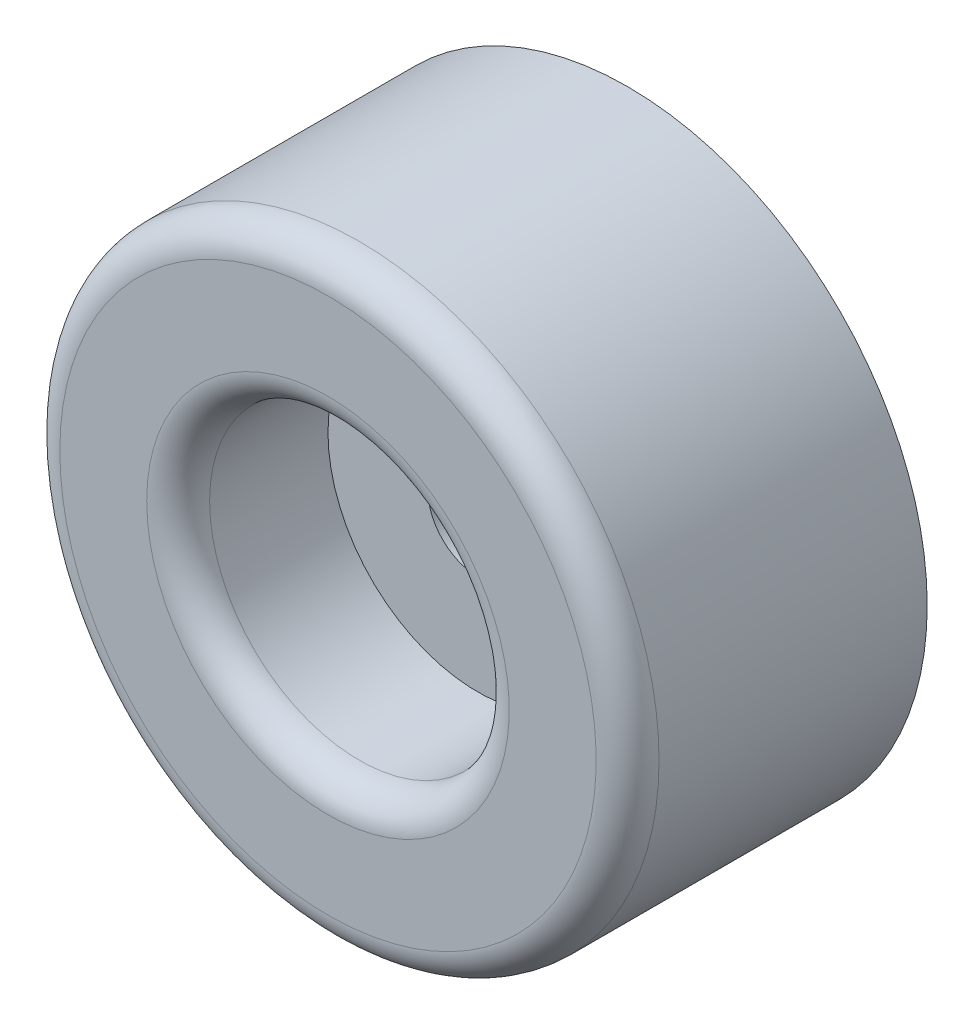
ISO-10303-21;
HEADER;
FILE_DESCRIPTION(('STEP AP214'),'2;1');
FILE_NAME('part.step','',(''),(''),'','','');
FILE_SCHEMA(('AUTOMOTIVE_DESIGN { 1 0 10303 214 1 1 1 1 }'));
ENDSEC;
DATA;
#1=APPLICATION_CONTEXT('core data for automotive mechanical design processes');
#2=APPLICATION_PROTOCOL_DEFINITION('international standard','automotive_design',2000,#1);
#3=PRODUCT_CONTEXT('',#1,'mechanical');
#4=PRODUCT('Part','Part','',(#3));
#5=PRODUCT_RELATED_PRODUCT_CATEGORY('part','',(#4));
#6=PRODUCT_DEFINITION_FORMATION('','',#4);
#7=PRODUCT_DEFINITION_CONTEXT('part definition',#1,'design');
#8=PRODUCT_DEFINITION('design','',#6,#7);
#9=PRODUCT_DEFINITION_SHAPE('','',#8);
#10=(LENGTH_UNIT() NAMED_UNIT(*) SI_UNIT(.MILLI.,.METRE.));
#11=(NAMED_UNIT(*) PLANE_ANGLE_UNIT() SI_UNIT($,.RADIAN.));
#12=(NAMED_UNIT(*) SI_UNIT($,.STERADIAN.) SOLID_ANGLE_UNIT());
#13=UNCERTAINTY_MEASURE_WITH_UNIT(LENGTH_MEASURE(1.E-05),#10,'distance_accuracy_value','');
#14=(GEOMETRIC_REPRESENTATION_CONTEXT(3) GLOBAL_UNCERTAINTY_ASSIGNED_CONTEXT((#13)) GLOBAL_UNIT_ASSIGNED_CONTEXT((#10,
#11,#12)) REPRESENTATION_CONTEXT('',''));
#15=CARTESIAN_POINT('',(0.,0.,0.));
#16=DIRECTION('',(0.,0.,1.));
#17=DIRECTION('',(1.,0.,0.));
#18=AXIS2_PLACEMENT_3D('',#15,#16,#17);
#19=CARTESIAN_POINT('',(0.,0.,13.1472968453587));
#20=DIRECTION('',(0.,0.,1.));
#21=DIRECTION('',(1.,0.,0.));
#22=AXIS2_PLACEMENT_3D('',#19,#20,#21);
#23=CYLINDRICAL_SURFACE('',#22,19.05);
#24=CARTESIAN_POINT('',(0.,0.,17.05));
#25=DIRECTION('',(0.,0.,-1.));
#26=DIRECTION('',(-1.,0.,0.));
#27=AXIS2_PLACEMENT_3D('',#24,#25,#26);
#28=CIRCLE('',#27,19.05);
#29=CARTESIAN_POINT('',(-19.05,0.,17.05));
#30=VERTEX_POINT('',#29);
#31=EDGE_CURVE('E10',#30,#30,#28,.T.);
#32=ORIENTED_EDGE('',*,*,#31,.T.);
#33=EDGE_LOOP('',(#32));
#34=FACE_BOUND('',#33,.T.);
#35=CARTESIAN_POINT('',(0.,0.,0.));
#36=DIRECTION('',(0.,0.,1.));
#37=DIRECTION('',(1.,0.,0.));
#38=AXIS2_PLACEMENT_3D('',#35,#36,#37);
#39=CIRCLE('',#38,19.05);
#40=CARTESIAN_POINT('',(19.05,0.,0.));
#41=VERTEX_POINT('',#40);
#42=EDGE_CURVE('E62',#41,#41,#39,.T.);
#43=ORIENTED_EDGE('',*,*,#42,.T.);
#44=EDGE_LOOP('',(#43));
#45=FACE_BOUND('',#44,.T.);
#46=ADVANCED_FACE('F33',(#34,#45),#23,.T.);
#47=CARTESIAN_POINT('',(0.,19.05,19.05));
#48=DIRECTION('',(0.,0.,-1.));
#49=DIRECTION('',(-1.,0.,0.));
#50=AXIS2_PLACEMENT_3D('',#47,#48,#49);
#51=PLANE('',#50);
#52=CARTESIAN_POINT('',(0.,0.,19.05));
#53=DIRECTION('',(0.,0.,-1.));
#54=DIRECTION('',(-1.,0.,0.));
#55=AXIS2_PLACEMENT_3D('',#52,#53,#54);
#56=CIRCLE('',#55,11.525);
#57=CARTESIAN_POINT('',(-11.525,0.,19.05));
#58=VERTEX_POINT('',#57);
#59=EDGE_CURVE('E40',#58,#58,#56,.T.);
#60=ORIENTED_EDGE('',*,*,#59,.T.);
#61=EDGE_LOOP('',(#60));
#62=FACE_BOUND('',#61,.T.);
#63=CARTESIAN_POINT('',(0.,0.,19.05));
#64=DIRECTION('',(0.,0.,-1.));
#65=DIRECTION('',(-1.,0.,0.));
#66=AXIS2_PLACEMENT_3D('',#63,#64,#65);
#67=CIRCLE('',#66,17.05);
#68=CARTESIAN_POINT('',(-17.05,0.,19.05));
#69=VERTEX_POINT('',#68);
#70=EDGE_CURVE('E44',#69,#69,#67,.F.);
#71=ORIENTED_EDGE('',*,*,#70,.T.);
#72=EDGE_LOOP('',(#71));
#73=FACE_BOUND('',#72,.T.);
#74=ADVANCED_FACE('F88',(#62,#73),#51,.F.);
#75=CARTESIAN_POINT('',(0.,0.,13.1472968453587));
#76=DIRECTION('',(0.,0.,1.));
#77=DIRECTION('',(1.,0.,0.));
#78=AXIS2_PLACEMENT_3D('',#75,#76,#77);
#79=CYLINDRICAL_SURFACE('',#78,9.525);
#80=CARTESIAN_POINT('',(0.,0.,17.05));
#81=DIRECTION('',(0.,0.,-1.));
#82=DIRECTION('',(-1.,0.,0.));
#83=AXIS2_PLACEMENT_3D('',#80,#81,#82);
#84=CIRCLE('',#83,9.525);
#85=CARTESIAN_POINT('',(-9.525,0.,17.05));
#86=VERTEX_POINT('',#85);
#87=EDGE_CURVE('E48',#86,#86,#84,.F.);
#88=ORIENTED_EDGE('',*,*,#87,.T.);
#89=EDGE_LOOP('',(#88));
#90=FACE_BOUND('',#89,.T.);
#91=CARTESIAN_POINT('',(0.,0.,9.525));
#92=DIRECTION('',(0.,0.,1.));
#93=DIRECTION('',(1.,0.,0.));
#94=AXIS2_PLACEMENT_3D('',#91,#92,#93);
#95=CIRCLE('',#94,9.525);
#96=CARTESIAN_POINT('',(9.525,0.,9.525));
#97=VERTEX_POINT('',#96);
#98=EDGE_CURVE('E53',#97,#97,#95,.T.);
#99=ORIENTED_EDGE('',*,*,#98,.F.);
#100=EDGE_LOOP('',(#99));
#101=FACE_BOUND('',#100,.T.);
#102=ADVANCED_FACE('F83',(#90,#101),#79,.F.);
#103=CARTESIAN_POINT('',(0.,9.525,9.525));
#104=DIRECTION('',(0.,0.,-1.));
#105=DIRECTION('',(-1.,0.,0.));
#106=AXIS2_PLACEMENT_3D('',#103,#104,#105);
#107=PLANE('',#106);
#108=CARTESIAN_POINT('',(0.,0.,9.525));
#109=DIRECTION('',(0.,0.,1.));
#110=DIRECTION('',(1.,0.,0.));
#111=AXIS2_PLACEMENT_3D('',#108,#109,#110);
#112=CIRCLE('',#111,3.175);
#113=CARTESIAN_POINT('',(3.175,0.,9.525));
#114=VERTEX_POINT('',#113);
#115=EDGE_CURVE('E56',#114,#114,#112,.T.);
#116=ORIENTED_EDGE('',*,*,#115,.F.);
#117=EDGE_LOOP('',(#116));
#118=FACE_BOUND('',#117,.T.);
#119=ORIENTED_EDGE('',*,*,#98,.T.);
#120=EDGE_LOOP('',(#119));
#121=FACE_BOUND('',#120,.T.);
#122=ADVANCED_FACE('F77',(#118,#121),#107,.F.);
#123=CARTESIAN_POINT('',(0.,0.,13.1472968453587));
#124=DIRECTION('',(0.,0.,1.));
#125=DIRECTION('',(1.,0.,0.));
#126=AXIS2_PLACEMENT_3D('',#123,#124,#125);
#127=CYLINDRICAL_SURFACE('',#126,3.175);
#128=CARTESIAN_POINT('',(0.,0.,0.));
#129=DIRECTION('',(0.,0.,1.));
#130=DIRECTION('',(1.,0.,0.));
#131=AXIS2_PLACEMENT_3D('',#128,#129,#130);
#132=CIRCLE('',#131,3.175);
#133=CARTESIAN_POINT('',(3.175,0.,0.));
#134=VERTEX_POINT('',#133);
#135=EDGE_CURVE('E59',#134,#134,#132,.T.);
#136=ORIENTED_EDGE('',*,*,#135,.F.);
#137=EDGE_LOOP('',(#136));
#138=FACE_BOUND('',#137,.T.);
#139=ORIENTED_EDGE('',*,*,#115,.T.);
#140=EDGE_LOOP('',(#139));
#141=FACE_BOUND('',#140,.T.);
#142=ADVANCED_FACE('F71',(#138,#141),#127,.F.);
#143=CARTESIAN_POINT('',(0.,3.175,0.));
#144=DIRECTION('',(0.,0.,1.));
#145=DIRECTION('',(1.,0.,0.));
#146=AXIS2_PLACEMENT_3D('',#143,#144,#145);
#147=PLANE('',#146);
#148=ORIENTED_EDGE('',*,*,#42,.F.);
#149=EDGE_LOOP('',(#148));
#150=FACE_BOUND('',#149,.T.);
#151=ORIENTED_EDGE('',*,*,#135,.T.);
#152=EDGE_LOOP('',(#151));
#153=FACE_BOUND('',#152,.T.);
#154=ADVANCED_FACE('F67',(#150,#153),#147,.F.);
#155=CARTESIAN_POINT('',(0.,0.,17.05));
#156=DIRECTION('',(0.,0.,-1.));
#157=DIRECTION('',(-1.,0.,0.));
#158=AXIS2_PLACEMENT_3D('',#155,#156,#157);
#159=TOROIDAL_SURFACE('',#158,11.525,2.);
#160=ORIENTED_EDGE('',*,*,#59,.F.);
#161=EDGE_LOOP('',(#160));
#162=FACE_BOUND('',#161,.T.);
#163=ORIENTED_EDGE('',*,*,#87,.F.);
#164=EDGE_LOOP('',(#163));
#165=FACE_BOUND('',#164,.T.);
#166=ADVANCED_FACE('F70',(#162,#165),#159,.T.);
#167=CARTESIAN_POINT('',(0.,0.,17.05));
#168=DIRECTION('',(0.,0.,-1.));
#169=DIRECTION('',(-1.,0.,0.));
#170=AXIS2_PLACEMENT_3D('',#167,#168,#169);
#171=TOROIDAL_SURFACE('',#170,17.05,2.);
#172=ORIENTED_EDGE('',*,*,#31,.F.);
#173=EDGE_LOOP('',(#172));
#174=FACE_BOUND('',#173,.T.);
#175=ORIENTED_EDGE('',*,*,#70,.F.);
#176=EDGE_LOOP('',(#175));
#177=FACE_BOUND('',#176,.T.);
#178=ADVANCED_FACE('F35',(#174,#177),#171,.T.);
#179=CLOSED_SHELL('',(#46,#74,#102,#122,#142,#154,#166,#178));
#180=MANIFOLD_SOLID_BREP('B2',#179);
#181=ADVANCED_BREP_SHAPE_REPRESENTATION('',(#18,#180),#14);
#182=SHAPE_DEFINITION_REPRESENTATION(#9,#181);
ENDSEC;
END-ISO-10303-21;
